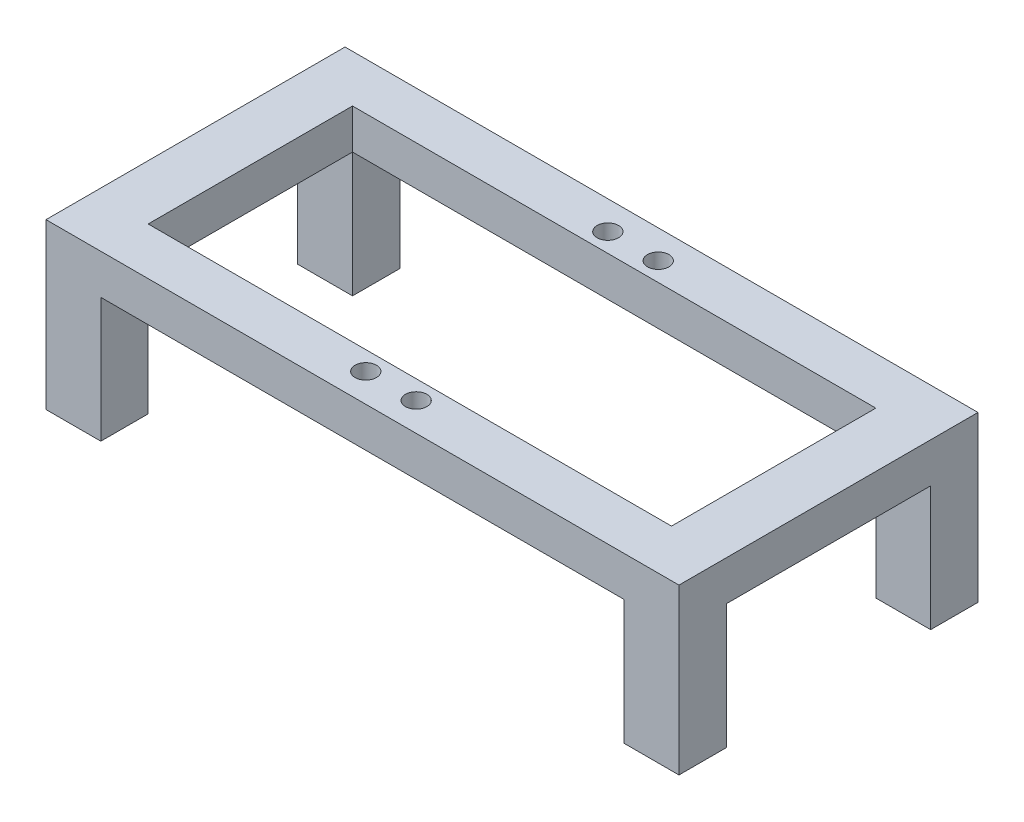
ISO-10303-21;
HEADER;
FILE_DESCRIPTION(('STEP AP214'),'2;1');
FILE_NAME('part.step','',(''),(''),'','','');
FILE_SCHEMA(('AUTOMOTIVE_DESIGN { 1 0 10303 214 1 1 1 1 }'));
ENDSEC;
DATA;
#1=APPLICATION_CONTEXT('core data for automotive mechanical design processes');
#2=APPLICATION_PROTOCOL_DEFINITION('international standard','automotive_design',2000,#1);
#3=PRODUCT_CONTEXT('',#1,'mechanical');
#4=PRODUCT('Part','Part','',(#3));
#5=PRODUCT_RELATED_PRODUCT_CATEGORY('part','',(#4));
#6=PRODUCT_DEFINITION_FORMATION('','',#4);
#7=PRODUCT_DEFINITION_CONTEXT('part definition',#1,'design');
#8=PRODUCT_DEFINITION('design','',#6,#7);
#9=PRODUCT_DEFINITION_SHAPE('','',#8);
#10=(LENGTH_UNIT() NAMED_UNIT(*) SI_UNIT(.MILLI.,.METRE.));
#11=(NAMED_UNIT(*) PLANE_ANGLE_UNIT() SI_UNIT($,.RADIAN.));
#12=(NAMED_UNIT(*) SI_UNIT($,.STERADIAN.) SOLID_ANGLE_UNIT());
#13=UNCERTAINTY_MEASURE_WITH_UNIT(LENGTH_MEASURE(1.E-05),#10,'distance_accuracy_value','');
#14=(GEOMETRIC_REPRESENTATION_CONTEXT(3) GLOBAL_UNCERTAINTY_ASSIGNED_CONTEXT((#13)) GLOBAL_UNIT_ASSIGNED_CONTEXT((#10,
#11,#12)) REPRESENTATION_CONTEXT('',''));
#15=CARTESIAN_POINT('',(0.,0.,0.));
#16=DIRECTION('',(0.,0.,1.));
#17=DIRECTION('',(1.,0.,0.));
#18=AXIS2_PLACEMENT_3D('',#15,#16,#17);
#19=CARTESIAN_POINT('',(0.,-8.,0.));
#20=DIRECTION('',(0.,1.,0.));
#21=DIRECTION('',(0.,0.,1.));
#22=AXIS2_PLACEMENT_3D('',#19,#20,#21);
#23=PLANE('',#22);
#24=DIRECTION('',(0.,0.,1.));
#25=VECTOR('',#24,1.);
#26=CARTESIAN_POINT('',(-52.5,-8.,-30.));
#27=LINE('',#26,#25);
#28=CARTESIAN_POINT('',(-52.5,-8.,-30.));
#29=VERTEX_POINT('',#28);
#30=CARTESIAN_POINT('',(-52.5,-8.,-20.5));
#31=VERTEX_POINT('',#30);
#32=EDGE_CURVE('E185',#29,#31,#27,.T.);
#33=ORIENTED_EDGE('',*,*,#32,.F.);
#34=DIRECTION('',(-1.,0.,0.));
#35=VECTOR('',#34,1.);
#36=CARTESIAN_POINT('',(-63.5,-8.,-30.));
#37=LINE('',#36,#35);
#38=CARTESIAN_POINT('',(52.5,-8.,-30.));
#39=VERTEX_POINT('',#38);
#40=EDGE_CURVE('E321',#39,#29,#37,.T.);
#41=ORIENTED_EDGE('',*,*,#40,.F.);
#42=DIRECTION('',(0.,0.,-1.));
#43=VECTOR('',#42,1.);
#44=CARTESIAN_POINT('',(52.5,-8.,-30.));
#45=LINE('',#44,#43);
#46=CARTESIAN_POINT('',(52.5,-8.,-20.5));
#47=VERTEX_POINT('',#46);
#48=EDGE_CURVE('E202',#47,#39,#45,.T.);
#49=ORIENTED_EDGE('',*,*,#48,.F.);
#50=DIRECTION('',(-1.,0.,0.));
#51=VECTOR('',#50,1.);
#52=CARTESIAN_POINT('',(-52.5,-8.,-20.5));
#53=LINE('',#52,#51);
#54=EDGE_CURVE('E290',#47,#31,#53,.T.);
#55=ORIENTED_EDGE('',*,*,#54,.T.);
#56=EDGE_LOOP('',(#33,#41,#49,#55));
#57=FACE_BOUND('',#56,.T.);
#58=ADVANCED_FACE('F33',(#57),#23,.F.);
#59=DIRECTION('',(-1.,0.,0.));
#60=VECTOR('',#59,1.);
#61=CARTESIAN_POINT('',(-63.5,-8.,-20.5));
#62=LINE('',#61,#60);
#63=CARTESIAN_POINT('',(-63.5,-8.,-20.5));
#64=VERTEX_POINT('',#63);
#65=EDGE_CURVE('E183',#31,#64,#62,.T.);
#66=ORIENTED_EDGE('',*,*,#65,.F.);
#67=DIRECTION('',(0.,0.,1.));
#68=VECTOR('',#67,1.);
#69=CARTESIAN_POINT('',(-52.5,-8.,-20.5));
#70=LINE('',#69,#68);
#71=CARTESIAN_POINT('',(-52.5,-8.,20.5));
#72=VERTEX_POINT('',#71);
#73=EDGE_CURVE('E294',#31,#72,#70,.T.);
#74=ORIENTED_EDGE('',*,*,#73,.T.);
#75=DIRECTION('',(1.,0.,0.));
#76=VECTOR('',#75,1.);
#77=CARTESIAN_POINT('',(-63.5,-8.,20.5));
#78=LINE('',#77,#76);
#79=CARTESIAN_POINT('',(-63.5,-8.,20.5));
#80=VERTEX_POINT('',#79);
#81=EDGE_CURVE('E237',#80,#72,#78,.T.);
#82=ORIENTED_EDGE('',*,*,#81,.F.);
#83=DIRECTION('',(0.,0.,1.));
#84=VECTOR('',#83,1.);
#85=CARTESIAN_POINT('',(-63.5,-8.,-30.));
#86=LINE('',#85,#84);
#87=EDGE_CURVE('E58',#64,#80,#86,.T.);
#88=ORIENTED_EDGE('',*,*,#87,.F.);
#89=EDGE_LOOP('',(#66,#74,#82,#88));
#90=FACE_BOUND('',#89,.T.);
#91=ADVANCED_FACE('F370',(#90),#23,.F.);
#92=DIRECTION('',(-1.,0.,0.));
#93=VECTOR('',#92,1.);
#94=CARTESIAN_POINT('',(63.5,-8.,-20.5));
#95=LINE('',#94,#93);
#96=CARTESIAN_POINT('',(63.5,-8.,-20.5));
#97=VERTEX_POINT('',#96);
#98=EDGE_CURVE('E197',#97,#47,#95,.T.);
#99=ORIENTED_EDGE('',*,*,#98,.F.);
#100=DIRECTION('',(0.,0.,-1.));
#101=VECTOR('',#100,1.);
#102=CARTESIAN_POINT('',(63.5,-8.,-30.));
#103=LINE('',#102,#101);
#104=CARTESIAN_POINT('',(63.5,-8.,20.5));
#105=VERTEX_POINT('',#104);
#106=EDGE_CURVE('E318',#105,#97,#103,.T.);
#107=ORIENTED_EDGE('',*,*,#106,.F.);
#108=DIRECTION('',(1.,0.,0.));
#109=VECTOR('',#108,1.);
#110=CARTESIAN_POINT('',(63.5,-8.,20.5));
#111=LINE('',#110,#109);
#112=CARTESIAN_POINT('',(52.5,-8.,20.5));
#113=VERTEX_POINT('',#112);
#114=EDGE_CURVE('E221',#113,#105,#111,.T.);
#115=ORIENTED_EDGE('',*,*,#114,.F.);
#116=DIRECTION('',(0.,0.,-1.));
#117=VECTOR('',#116,1.);
#118=CARTESIAN_POINT('',(52.5,-8.,-20.5));
#119=LINE('',#118,#117);
#120=EDGE_CURVE('E287',#113,#47,#119,.T.);
#121=ORIENTED_EDGE('',*,*,#120,.T.);
#122=EDGE_LOOP('',(#99,#107,#115,#121));
#123=FACE_BOUND('',#122,.T.);
#124=ADVANCED_FACE('F413',(#123),#23,.F.);
#125=DIRECTION('',(0.,0.,-1.));
#126=VECTOR('',#125,1.);
#127=CARTESIAN_POINT('',(52.5,-8.,30.));
#128=LINE('',#127,#126);
#129=CARTESIAN_POINT('',(52.5,-8.,30.));
#130=VERTEX_POINT('',#129);
#131=EDGE_CURVE('E216',#130,#113,#128,.T.);
#132=ORIENTED_EDGE('',*,*,#131,.F.);
#133=DIRECTION('',(1.,0.,0.));
#134=VECTOR('',#133,1.);
#135=CARTESIAN_POINT('',(-63.5,-8.,30.));
#136=LINE('',#135,#134);
#137=CARTESIAN_POINT('',(-52.5,-8.,30.));
#138=VERTEX_POINT('',#137);
#139=EDGE_CURVE('E325',#138,#130,#136,.T.);
#140=ORIENTED_EDGE('',*,*,#139,.F.);
#141=DIRECTION('',(0.,0.,1.));
#142=VECTOR('',#141,1.);
#143=CARTESIAN_POINT('',(-52.5,-8.,30.));
#144=LINE('',#143,#142);
#145=EDGE_CURVE('E242',#72,#138,#144,.T.);
#146=ORIENTED_EDGE('',*,*,#145,.F.);
#147=DIRECTION('',(1.,0.,0.));
#148=VECTOR('',#147,1.);
#149=CARTESIAN_POINT('',(-52.5,-8.,20.5));
#150=LINE('',#149,#148);
#151=EDGE_CURVE('E296',#72,#113,#150,.T.);
#152=ORIENTED_EDGE('',*,*,#151,.T.);
#153=EDGE_LOOP('',(#132,#140,#146,#152));
#154=FACE_BOUND('',#153,.T.);
#155=ADVANCED_FACE('F390',(#154),#23,.F.);
#156=CARTESIAN_POINT('',(63.5,-8.,-30.));
#157=DIRECTION('',(1.,0.,0.));
#158=DIRECTION('',(0.,0.,-1.));
#159=AXIS2_PLACEMENT_3D('',#156,#157,#158);
#160=PLANE('',#159);
#161=DIRECTION('',(0.,0.,-1.));
#162=VECTOR('',#161,1.);
#163=CARTESIAN_POINT('',(63.5,0.,-30.));
#164=LINE('',#163,#162);
#165=CARTESIAN_POINT('',(63.5,0.,30.));
#166=VERTEX_POINT('',#165);
#167=CARTESIAN_POINT('',(63.5,0.,-30.));
#168=VERTEX_POINT('',#167);
#169=EDGE_CURVE('E311',#166,#168,#164,.T.);
#170=ORIENTED_EDGE('',*,*,#169,.F.);
#171=DIRECTION('',(0.,1.,0.));
#172=VECTOR('',#171,1.);
#173=CARTESIAN_POINT('',(63.5,-8.,30.));
#174=LINE('',#173,#172);
#175=CARTESIAN_POINT('',(63.5,-33.,30.));
#176=VERTEX_POINT('',#175);
#177=EDGE_CURVE('E11',#176,#166,#174,.T.);
#178=ORIENTED_EDGE('',*,*,#177,.F.);
#179=DIRECTION('',(0.,0.,1.));
#180=VECTOR('',#179,1.);
#181=CARTESIAN_POINT('',(63.5,-33.,30.));
#182=LINE('',#181,#180);
#183=CARTESIAN_POINT('',(63.5,-33.,20.5));
#184=VERTEX_POINT('',#183);
#185=EDGE_CURVE('E217',#184,#176,#182,.T.);
#186=ORIENTED_EDGE('',*,*,#185,.F.);
#187=DIRECTION('',(0.,1.,0.));
#188=VECTOR('',#187,1.);
#189=CARTESIAN_POINT('',(63.5,-33.,20.5));
#190=LINE('',#189,#188);
#191=EDGE_CURVE('E227',#184,#105,#190,.T.);
#192=ORIENTED_EDGE('',*,*,#191,.T.);
#193=ORIENTED_EDGE('',*,*,#106,.T.);
#194=DIRECTION('',(0.,1.,0.));
#195=VECTOR('',#194,1.);
#196=CARTESIAN_POINT('',(63.5,-33.,-20.5));
#197=LINE('',#196,#195);
#198=CARTESIAN_POINT('',(63.5,-33.,-20.5));
#199=VERTEX_POINT('',#198);
#200=EDGE_CURVE('E214',#199,#97,#197,.T.);
#201=ORIENTED_EDGE('',*,*,#200,.F.);
#202=DIRECTION('',(0.,0.,1.));
#203=VECTOR('',#202,1.);
#204=CARTESIAN_POINT('',(63.5,-33.,-30.));
#205=LINE('',#204,#203);
#206=CARTESIAN_POINT('',(63.5,-33.,-30.));
#207=VERTEX_POINT('',#206);
#208=EDGE_CURVE('E201',#207,#199,#205,.T.);
#209=ORIENTED_EDGE('',*,*,#208,.F.);
#210=DIRECTION('',(0.,1.,0.));
#211=VECTOR('',#210,1.);
#212=CARTESIAN_POINT('',(63.5,-8.,-30.));
#213=LINE('',#212,#211);
#214=EDGE_CURVE('E37',#207,#168,#213,.T.);
#215=ORIENTED_EDGE('',*,*,#214,.T.);
#216=EDGE_LOOP('',(#170,#178,#186,#192,#193,#201,#209,#215));
#217=FACE_BOUND('',#216,.T.);
#218=ADVANCED_FACE('F35',(#217),#160,.T.);
#219=CARTESIAN_POINT('',(-63.5,-8.,30.));
#220=DIRECTION('',(0.,0.,1.));
#221=DIRECTION('',(1.,0.,0.));
#222=AXIS2_PLACEMENT_3D('',#219,#220,#221);
#223=PLANE('',#222);
#224=DIRECTION('',(1.,0.,0.));
#225=VECTOR('',#224,1.);
#226=CARTESIAN_POINT('',(-63.5,0.,30.));
#227=LINE('',#226,#225);
#228=CARTESIAN_POINT('',(-63.5,0.,30.));
#229=VERTEX_POINT('',#228);
#230=EDGE_CURVE('E322',#229,#166,#227,.T.);
#231=ORIENTED_EDGE('',*,*,#230,.F.);
#232=DIRECTION('',(0.,1.,0.));
#233=VECTOR('',#232,1.);
#234=CARTESIAN_POINT('',(-63.5,-8.,30.));
#235=LINE('',#234,#233);
#236=CARTESIAN_POINT('',(-63.5,-33.,30.));
#237=VERTEX_POINT('',#236);
#238=EDGE_CURVE('E42',#237,#229,#235,.T.);
#239=ORIENTED_EDGE('',*,*,#238,.F.);
#240=DIRECTION('',(-1.,0.,0.));
#241=VECTOR('',#240,1.);
#242=CARTESIAN_POINT('',(-63.5,-33.,30.));
#243=LINE('',#242,#241);
#244=CARTESIAN_POINT('',(-52.5,-33.,30.));
#245=VERTEX_POINT('',#244);
#246=EDGE_CURVE('E246',#245,#237,#243,.T.);
#247=ORIENTED_EDGE('',*,*,#246,.F.);
#248=DIRECTION('',(0.,1.,0.));
#249=VECTOR('',#248,1.);
#250=CARTESIAN_POINT('',(-52.5,-33.,30.));
#251=LINE('',#250,#249);
#252=EDGE_CURVE('E249',#245,#138,#251,.T.);
#253=ORIENTED_EDGE('',*,*,#252,.T.);
#254=ORIENTED_EDGE('',*,*,#139,.T.);
#255=DIRECTION('',(0.,1.,0.));
#256=VECTOR('',#255,1.);
#257=CARTESIAN_POINT('',(52.5,-33.,30.));
#258=LINE('',#257,#256);
#259=CARTESIAN_POINT('',(52.5,-33.,30.));
#260=VERTEX_POINT('',#259);
#261=EDGE_CURVE('E235',#260,#130,#258,.T.);
#262=ORIENTED_EDGE('',*,*,#261,.F.);
#263=DIRECTION('',(-1.,0.,0.));
#264=VECTOR('',#263,1.);
#265=CARTESIAN_POINT('',(63.5,-33.,30.));
#266=LINE('',#265,#264);
#267=EDGE_CURVE('E220',#176,#260,#266,.T.);
#268=ORIENTED_EDGE('',*,*,#267,.F.);
#269=ORIENTED_EDGE('',*,*,#177,.T.);
#270=EDGE_LOOP('',(#231,#239,#247,#253,#254,#262,#268,#269));
#271=FACE_BOUND('',#270,.T.);
#272=ADVANCED_FACE('F341',(#271),#223,.T.);
#273=CARTESIAN_POINT('',(-63.5,-8.,-30.));
#274=DIRECTION('',(-1.,0.,0.));
#275=DIRECTION('',(0.,0.,1.));
#276=AXIS2_PLACEMENT_3D('',#273,#274,#275);
#277=PLANE('',#276);
#278=DIRECTION('',(0.,0.,1.));
#279=VECTOR('',#278,1.);
#280=CARTESIAN_POINT('',(-63.5,0.,-30.));
#281=LINE('',#280,#279);
#282=CARTESIAN_POINT('',(-63.5,0.,-30.));
#283=VERTEX_POINT('',#282);
#284=EDGE_CURVE('E168',#283,#229,#281,.T.);
#285=ORIENTED_EDGE('',*,*,#284,.F.);
#286=DIRECTION('',(0.,1.,0.));
#287=VECTOR('',#286,1.);
#288=CARTESIAN_POINT('',(-63.5,-8.,-30.));
#289=LINE('',#288,#287);
#290=CARTESIAN_POINT('',(-63.5,-33.,-30.));
#291=VERTEX_POINT('',#290);
#292=EDGE_CURVE('E162',#291,#283,#289,.T.);
#293=ORIENTED_EDGE('',*,*,#292,.F.);
#294=DIRECTION('',(0.,0.,-1.));
#295=VECTOR('',#294,1.);
#296=CARTESIAN_POINT('',(-63.5,-33.,-30.));
#297=LINE('',#296,#295);
#298=CARTESIAN_POINT('',(-63.5,-33.,-20.5));
#299=VERTEX_POINT('',#298);
#300=EDGE_CURVE('E166',#299,#291,#297,.T.);
#301=ORIENTED_EDGE('',*,*,#300,.F.);
#302=DIRECTION('',(0.,1.,0.));
#303=VECTOR('',#302,1.);
#304=CARTESIAN_POINT('',(-63.5,-33.,-20.5));
#305=LINE('',#304,#303);
#306=EDGE_CURVE('E190',#299,#64,#305,.T.);
#307=ORIENTED_EDGE('',*,*,#306,.T.);
#308=ORIENTED_EDGE('',*,*,#87,.T.);
#309=DIRECTION('',(0.,1.,0.));
#310=VECTOR('',#309,1.);
#311=CARTESIAN_POINT('',(-63.5,-33.,20.5));
#312=LINE('',#311,#310);
#313=CARTESIAN_POINT('',(-63.5,-33.,20.5));
#314=VERTEX_POINT('',#313);
#315=EDGE_CURVE('E259',#314,#80,#312,.T.);
#316=ORIENTED_EDGE('',*,*,#315,.F.);
#317=DIRECTION('',(0.,0.,-1.));
#318=VECTOR('',#317,1.);
#319=CARTESIAN_POINT('',(-63.5,-33.,30.));
#320=LINE('',#319,#318);
#321=EDGE_CURVE('E238',#237,#314,#320,.T.);
#322=ORIENTED_EDGE('',*,*,#321,.F.);
#323=ORIENTED_EDGE('',*,*,#238,.T.);
#324=EDGE_LOOP('',(#285,#293,#301,#307,#308,#316,#322,#323));
#325=FACE_BOUND('',#324,.T.);
#326=ADVANCED_FACE('F164',(#325),#277,.T.);
#327=CARTESIAN_POINT('',(-63.5,-8.,-30.));
#328=DIRECTION('',(0.,0.,-1.));
#329=DIRECTION('',(-1.,0.,0.));
#330=AXIS2_PLACEMENT_3D('',#327,#328,#329);
#331=PLANE('',#330);
#332=DIRECTION('',(-1.,0.,0.));
#333=VECTOR('',#332,1.);
#334=CARTESIAN_POINT('',(-63.5,0.,-30.));
#335=LINE('',#334,#333);
#336=EDGE_CURVE('E330',#168,#283,#335,.T.);
#337=ORIENTED_EDGE('',*,*,#336,.F.);
#338=ORIENTED_EDGE('',*,*,#214,.F.);
#339=DIRECTION('',(1.,0.,0.));
#340=VECTOR('',#339,1.);
#341=CARTESIAN_POINT('',(63.5,-33.,-30.));
#342=LINE('',#341,#340);
#343=CARTESIAN_POINT('',(52.5,-33.,-30.));
#344=VERTEX_POINT('',#343);
#345=EDGE_CURVE('E198',#344,#207,#342,.T.);
#346=ORIENTED_EDGE('',*,*,#345,.F.);
#347=DIRECTION('',(0.,1.,0.));
#348=VECTOR('',#347,1.);
#349=CARTESIAN_POINT('',(52.5,-33.,-30.));
#350=LINE('',#349,#348);
#351=EDGE_CURVE('E50',#344,#39,#350,.T.);
#352=ORIENTED_EDGE('',*,*,#351,.T.);
#353=ORIENTED_EDGE('',*,*,#40,.T.);
#354=DIRECTION('',(0.,1.,0.));
#355=VECTOR('',#354,1.);
#356=CARTESIAN_POINT('',(-52.5,-33.,-30.));
#357=LINE('',#356,#355);
#358=CARTESIAN_POINT('',(-52.5,-33.,-30.));
#359=VERTEX_POINT('',#358);
#360=EDGE_CURVE('E174',#359,#29,#357,.T.);
#361=ORIENTED_EDGE('',*,*,#360,.F.);
#362=DIRECTION('',(1.,0.,0.));
#363=VECTOR('',#362,1.);
#364=CARTESIAN_POINT('',(-63.5,-33.,-30.));
#365=LINE('',#364,#363);
#366=EDGE_CURVE('E172',#291,#359,#365,.T.);
#367=ORIENTED_EDGE('',*,*,#366,.F.);
#368=ORIENTED_EDGE('',*,*,#292,.T.);
#369=EDGE_LOOP('',(#337,#338,#346,#352,#353,#361,#367,#368));
#370=FACE_BOUND('',#369,.T.);
#371=ADVANCED_FACE('F173',(#370),#331,.T.);
#372=CARTESIAN_POINT('',(0.,0.,0.));
#373=DIRECTION('',(0.,1.,0.));
#374=DIRECTION('',(0.,0.,1.));
#375=AXIS2_PLACEMENT_3D('',#372,#373,#374);
#376=PLANE('',#375);
#377=CARTESIAN_POINT('',(-5.055,0.,24.285));
#378=DIRECTION('',(0.,1.,0.));
#379=DIRECTION('',(0.,0.,1.));
#380=AXIS2_PLACEMENT_3D('',#377,#378,#379);
#381=CIRCLE('',#380,2.15);
#382=CARTESIAN_POINT('',(-5.055,0.,26.435));
#383=VERTEX_POINT('',#382);
#384=EDGE_CURVE('E269',#383,#383,#381,.T.);
#385=ORIENTED_EDGE('',*,*,#384,.F.);
#386=EDGE_LOOP('',(#385));
#387=FACE_BOUND('',#386,.T.);
#388=CARTESIAN_POINT('',(5.055,0.,-24.285));
#389=DIRECTION('',(0.,1.,0.));
#390=DIRECTION('',(0.,0.,1.));
#391=AXIS2_PLACEMENT_3D('',#388,#389,#390);
#392=CIRCLE('',#391,2.15);
#393=CARTESIAN_POINT('',(5.055,0.,-22.135));
#394=VERTEX_POINT('',#393);
#395=EDGE_CURVE('E276',#394,#394,#392,.T.);
#396=ORIENTED_EDGE('',*,*,#395,.F.);
#397=EDGE_LOOP('',(#396));
#398=FACE_BOUND('',#397,.T.);
#399=CARTESIAN_POINT('',(-5.055,0.,-24.285));
#400=DIRECTION('',(0.,1.,0.));
#401=DIRECTION('',(0.,0.,1.));
#402=AXIS2_PLACEMENT_3D('',#399,#400,#401);
#403=CIRCLE('',#402,2.15);
#404=CARTESIAN_POINT('',(-5.055,0.,-22.135));
#405=VERTEX_POINT('',#404);
#406=EDGE_CURVE('E263',#405,#405,#403,.T.);
#407=ORIENTED_EDGE('',*,*,#406,.F.);
#408=EDGE_LOOP('',(#407));
#409=FACE_BOUND('',#408,.T.);
#410=CARTESIAN_POINT('',(5.055,0.,24.285));
#411=DIRECTION('',(0.,1.,0.));
#412=DIRECTION('',(0.,0.,1.));
#413=AXIS2_PLACEMENT_3D('',#410,#411,#412);
#414=CIRCLE('',#413,2.15);
#415=CARTESIAN_POINT('',(5.055,0.,26.435));
#416=VERTEX_POINT('',#415);
#417=EDGE_CURVE('E272',#416,#416,#414,.T.);
#418=ORIENTED_EDGE('',*,*,#417,.F.);
#419=EDGE_LOOP('',(#418));
#420=FACE_BOUND('',#419,.T.);
#421=DIRECTION('',(0.,0.,-1.));
#422=VECTOR('',#421,1.);
#423=CARTESIAN_POINT('',(52.5,0.,-20.5));
#424=LINE('',#423,#422);
#425=CARTESIAN_POINT('',(52.5,0.,20.5));
#426=VERTEX_POINT('',#425);
#427=CARTESIAN_POINT('',(52.5,0.,-20.5));
#428=VERTEX_POINT('',#427);
#429=EDGE_CURVE('E284',#426,#428,#424,.T.);
#430=ORIENTED_EDGE('',*,*,#429,.F.);
#431=DIRECTION('',(1.,0.,0.));
#432=VECTOR('',#431,1.);
#433=CARTESIAN_POINT('',(-52.5,0.,20.5));
#434=LINE('',#433,#432);
#435=CARTESIAN_POINT('',(-52.5,0.,20.5));
#436=VERTEX_POINT('',#435);
#437=EDGE_CURVE('E291',#436,#426,#434,.T.);
#438=ORIENTED_EDGE('',*,*,#437,.F.);
#439=DIRECTION('',(0.,0.,1.));
#440=VECTOR('',#439,1.);
#441=CARTESIAN_POINT('',(-52.5,0.,-20.5));
#442=LINE('',#441,#440);
#443=CARTESIAN_POINT('',(-52.5,0.,-20.5));
#444=VERTEX_POINT('',#443);
#445=EDGE_CURVE('E304',#444,#436,#442,.T.);
#446=ORIENTED_EDGE('',*,*,#445,.F.);
#447=DIRECTION('',(-1.,0.,0.));
#448=VECTOR('',#447,1.);
#449=CARTESIAN_POINT('',(-52.5,0.,-20.5));
#450=LINE('',#449,#448);
#451=EDGE_CURVE('E301',#428,#444,#450,.T.);
#452=ORIENTED_EDGE('',*,*,#451,.F.);
#453=EDGE_LOOP('',(#430,#438,#446,#452));
#454=FACE_BOUND('',#453,.T.);
#455=ORIENTED_EDGE('',*,*,#169,.T.);
#456=ORIENTED_EDGE('',*,*,#336,.T.);
#457=ORIENTED_EDGE('',*,*,#284,.T.);
#458=ORIENTED_EDGE('',*,*,#230,.T.);
#459=EDGE_LOOP('',(#455,#456,#457,#458));
#460=FACE_BOUND('',#459,.T.);
#461=ADVANCED_FACE('F340',(#387,#398,#409,#420,#454,#460),#376,.T.);
#462=CARTESIAN_POINT('',(52.5,-8.,-20.5));
#463=DIRECTION('',(1.,0.,0.));
#464=DIRECTION('',(0.,0.,-1.));
#465=AXIS2_PLACEMENT_3D('',#462,#463,#464);
#466=PLANE('',#465);
#467=ORIENTED_EDGE('',*,*,#429,.T.);
#468=DIRECTION('',(0.,1.,0.));
#469=VECTOR('',#468,1.);
#470=CARTESIAN_POINT('',(52.5,-8.,-20.5));
#471=LINE('',#470,#469);
#472=EDGE_CURVE('E299',#47,#428,#471,.T.);
#473=ORIENTED_EDGE('',*,*,#472,.F.);
#474=ORIENTED_EDGE('',*,*,#120,.F.);
#475=DIRECTION('',(0.,1.,0.));
#476=VECTOR('',#475,1.);
#477=CARTESIAN_POINT('',(52.5,-8.,20.5));
#478=LINE('',#477,#476);
#479=EDGE_CURVE('E309',#113,#426,#478,.T.);
#480=ORIENTED_EDGE('',*,*,#479,.T.);
#481=EDGE_LOOP('',(#467,#473,#474,#480));
#482=FACE_BOUND('',#481,.T.);
#483=ADVANCED_FACE('F605',(#482),#466,.F.);
#484=CARTESIAN_POINT('',(-52.5,-8.,20.5));
#485=DIRECTION('',(0.,0.,1.));
#486=DIRECTION('',(1.,0.,0.));
#487=AXIS2_PLACEMENT_3D('',#484,#485,#486);
#488=PLANE('',#487);
#489=ORIENTED_EDGE('',*,*,#437,.T.);
#490=ORIENTED_EDGE('',*,*,#479,.F.);
#491=ORIENTED_EDGE('',*,*,#151,.F.);
#492=DIRECTION('',(0.,1.,0.));
#493=VECTOR('',#492,1.);
#494=CARTESIAN_POINT('',(-52.5,-8.,20.5));
#495=LINE('',#494,#493);
#496=EDGE_CURVE('E312',#72,#436,#495,.T.);
#497=ORIENTED_EDGE('',*,*,#496,.T.);
#498=EDGE_LOOP('',(#489,#490,#491,#497));
#499=FACE_BOUND('',#498,.T.);
#500=ADVANCED_FACE('F386',(#499),#488,.F.);
#501=CARTESIAN_POINT('',(-52.5,-8.,-20.5));
#502=DIRECTION('',(-1.,0.,0.));
#503=DIRECTION('',(0.,0.,1.));
#504=AXIS2_PLACEMENT_3D('',#501,#502,#503);
#505=PLANE('',#504);
#506=ORIENTED_EDGE('',*,*,#445,.T.);
#507=ORIENTED_EDGE('',*,*,#496,.F.);
#508=ORIENTED_EDGE('',*,*,#73,.F.);
#509=DIRECTION('',(0.,1.,0.));
#510=VECTOR('',#509,1.);
#511=CARTESIAN_POINT('',(-52.5,-8.,-20.5));
#512=LINE('',#511,#510);
#513=EDGE_CURVE('E314',#31,#444,#512,.T.);
#514=ORIENTED_EDGE('',*,*,#513,.T.);
#515=EDGE_LOOP('',(#506,#507,#508,#514));
#516=FACE_BOUND('',#515,.T.);
#517=ADVANCED_FACE('F375',(#516),#505,.F.);
#518=CARTESIAN_POINT('',(-52.5,-8.,-20.5));
#519=DIRECTION('',(0.,0.,-1.));
#520=DIRECTION('',(-1.,0.,0.));
#521=AXIS2_PLACEMENT_3D('',#518,#519,#520);
#522=PLANE('',#521);
#523=ORIENTED_EDGE('',*,*,#451,.T.);
#524=ORIENTED_EDGE('',*,*,#513,.F.);
#525=ORIENTED_EDGE('',*,*,#54,.F.);
#526=ORIENTED_EDGE('',*,*,#472,.T.);
#527=EDGE_LOOP('',(#523,#524,#525,#526));
#528=FACE_BOUND('',#527,.T.);
#529=ADVANCED_FACE('F378',(#528),#522,.F.);
#530=CARTESIAN_POINT('',(5.055,-5.159375,24.285));
#531=DIRECTION('',(0.,1.,0.));
#532=DIRECTION('',(0.,0.,1.));
#533=AXIS2_PLACEMENT_3D('',#530,#531,#532);
#534=CYLINDRICAL_SURFACE('',#533,2.15);
#535=CARTESIAN_POINT('',(5.055,-5.159375,24.285));
#536=DIRECTION('',(0.,1.,0.));
#537=DIRECTION('',(0.,0.,1.));
#538=AXIS2_PLACEMENT_3D('',#535,#536,#537);
#539=CIRCLE('',#538,2.15);
#540=CARTESIAN_POINT('',(5.055,-5.159375,26.435));
#541=VERTEX_POINT('',#540);
#542=EDGE_CURVE('E281',#541,#541,#539,.T.);
#543=ORIENTED_EDGE('',*,*,#542,.F.);
#544=EDGE_LOOP('',(#543));
#545=FACE_BOUND('',#544,.T.);
#546=ORIENTED_EDGE('',*,*,#417,.T.);
#547=EDGE_LOOP('',(#546));
#548=FACE_BOUND('',#547,.T.);
#549=ADVANCED_FACE('F633',(#545,#548),#534,.F.);
#550=CARTESIAN_POINT('',(5.055,-5.159375,24.285));
#551=DIRECTION('',(0.,1.,0.));
#552=DIRECTION('',(0.,0.,1.));
#553=AXIS2_PLACEMENT_3D('',#550,#551,#552);
#554=PLANE('',#553);
#555=ORIENTED_EDGE('',*,*,#542,.T.);
#556=EDGE_LOOP('',(#555));
#557=FACE_BOUND('',#556,.T.);
#558=ADVANCED_FACE('F640',(#557),#554,.T.);
#559=CARTESIAN_POINT('',(-5.055,-5.159375,-24.285));
#560=DIRECTION('',(0.,1.,0.));
#561=DIRECTION('',(0.,0.,1.));
#562=AXIS2_PLACEMENT_3D('',#559,#560,#561);
#563=CYLINDRICAL_SURFACE('',#562,2.15);
#564=CARTESIAN_POINT('',(-5.055,-5.159375,-24.285));
#565=DIRECTION('',(0.,1.,0.));
#566=DIRECTION('',(0.,0.,1.));
#567=AXIS2_PLACEMENT_3D('',#564,#565,#566);
#568=CIRCLE('',#567,2.15);
#569=CARTESIAN_POINT('',(-5.055,-5.159375,-22.135));
#570=VERTEX_POINT('',#569);
#571=EDGE_CURVE('E262',#570,#570,#568,.T.);
#572=ORIENTED_EDGE('',*,*,#571,.F.);
#573=EDGE_LOOP('',(#572));
#574=FACE_BOUND('',#573,.T.);
#575=ORIENTED_EDGE('',*,*,#406,.T.);
#576=EDGE_LOOP('',(#575));
#577=FACE_BOUND('',#576,.T.);
#578=ADVANCED_FACE('F649',(#574,#577),#563,.F.);
#579=CARTESIAN_POINT('',(-5.055,-5.159375,-24.285));
#580=DIRECTION('',(0.,1.,0.));
#581=DIRECTION('',(0.,0.,1.));
#582=AXIS2_PLACEMENT_3D('',#579,#580,#581);
#583=PLANE('',#582);
#584=ORIENTED_EDGE('',*,*,#571,.T.);
#585=EDGE_LOOP('',(#584));
#586=FACE_BOUND('',#585,.T.);
#587=ADVANCED_FACE('F658',(#586),#583,.T.);
#588=CARTESIAN_POINT('',(5.055,-5.159375,-24.285));
#589=DIRECTION('',(0.,1.,0.));
#590=DIRECTION('',(0.,0.,1.));
#591=AXIS2_PLACEMENT_3D('',#588,#589,#590);
#592=CYLINDRICAL_SURFACE('',#591,2.15);
#593=CARTESIAN_POINT('',(5.055,-5.159375,-24.285));
#594=DIRECTION('',(0.,1.,0.));
#595=DIRECTION('',(0.,0.,1.));
#596=AXIS2_PLACEMENT_3D('',#593,#594,#595);
#597=CIRCLE('',#596,2.15);
#598=CARTESIAN_POINT('',(5.055,-5.159375,-22.135));
#599=VERTEX_POINT('',#598);
#600=EDGE_CURVE('E266',#599,#599,#597,.T.);
#601=ORIENTED_EDGE('',*,*,#600,.F.);
#602=EDGE_LOOP('',(#601));
#603=FACE_BOUND('',#602,.T.);
#604=ORIENTED_EDGE('',*,*,#395,.T.);
#605=EDGE_LOOP('',(#604));
#606=FACE_BOUND('',#605,.T.);
#607=ADVANCED_FACE('F667',(#603,#606),#592,.F.);
#608=CARTESIAN_POINT('',(5.055,-5.159375,-24.285));
#609=DIRECTION('',(0.,1.,0.));
#610=DIRECTION('',(0.,0.,1.));
#611=AXIS2_PLACEMENT_3D('',#608,#609,#610);
#612=PLANE('',#611);
#613=ORIENTED_EDGE('',*,*,#600,.T.);
#614=EDGE_LOOP('',(#613));
#615=FACE_BOUND('',#614,.T.);
#616=ADVANCED_FACE('F676',(#615),#612,.T.);
#617=CARTESIAN_POINT('',(-5.055,-5.159375,24.285));
#618=DIRECTION('',(0.,1.,0.));
#619=DIRECTION('',(0.,0.,1.));
#620=AXIS2_PLACEMENT_3D('',#617,#618,#619);
#621=CYLINDRICAL_SURFACE('',#620,2.15);
#622=CARTESIAN_POINT('',(-5.055,-5.159375,24.285));
#623=DIRECTION('',(0.,1.,0.));
#624=DIRECTION('',(0.,0.,1.));
#625=AXIS2_PLACEMENT_3D('',#622,#623,#624);
#626=CIRCLE('',#625,2.15);
#627=CARTESIAN_POINT('',(-5.055,-5.159375,26.435));
#628=VERTEX_POINT('',#627);
#629=EDGE_CURVE('E273',#628,#628,#626,.T.);
#630=ORIENTED_EDGE('',*,*,#629,.F.);
#631=EDGE_LOOP('',(#630));
#632=FACE_BOUND('',#631,.T.);
#633=ORIENTED_EDGE('',*,*,#384,.T.);
#634=EDGE_LOOP('',(#633));
#635=FACE_BOUND('',#634,.T.);
#636=ADVANCED_FACE('F685',(#632,#635),#621,.F.);
#637=CARTESIAN_POINT('',(-5.055,-5.159375,24.285));
#638=DIRECTION('',(0.,1.,0.));
#639=DIRECTION('',(0.,0.,1.));
#640=AXIS2_PLACEMENT_3D('',#637,#638,#639);
#641=PLANE('',#640);
#642=ORIENTED_EDGE('',*,*,#629,.T.);
#643=EDGE_LOOP('',(#642));
#644=FACE_BOUND('',#643,.T.);
#645=ADVANCED_FACE('F482',(#644),#641,.T.);
#646=CARTESIAN_POINT('',(-63.5,-33.,20.5));
#647=DIRECTION('',(0.,0.,1.));
#648=DIRECTION('',(1.,0.,0.));
#649=AXIS2_PLACEMENT_3D('',#646,#647,#648);
#650=PLANE('',#649);
#651=ORIENTED_EDGE('',*,*,#81,.T.);
#652=DIRECTION('',(0.,1.,0.));
#653=VECTOR('',#652,1.);
#654=CARTESIAN_POINT('',(-52.5,-33.,20.5));
#655=LINE('',#654,#653);
#656=CARTESIAN_POINT('',(-52.5,-33.,20.5));
#657=VERTEX_POINT('',#656);
#658=EDGE_CURVE('E256',#657,#72,#655,.T.);
#659=ORIENTED_EDGE('',*,*,#658,.F.);
#660=DIRECTION('',(1.,0.,0.));
#661=VECTOR('',#660,1.);
#662=CARTESIAN_POINT('',(-63.5,-33.,20.5));
#663=LINE('',#662,#661);
#664=EDGE_CURVE('E241',#314,#657,#663,.T.);
#665=ORIENTED_EDGE('',*,*,#664,.F.);
#666=ORIENTED_EDGE('',*,*,#315,.T.);
#667=EDGE_LOOP('',(#651,#659,#665,#666));
#668=FACE_BOUND('',#667,.T.);
#669=ADVANCED_FACE('F395',(#668),#650,.F.);
#670=CARTESIAN_POINT('',(-52.5,-33.,30.));
#671=DIRECTION('',(-1.,0.,0.));
#672=DIRECTION('',(0.,0.,1.));
#673=AXIS2_PLACEMENT_3D('',#670,#671,#672);
#674=PLANE('',#673);
#675=ORIENTED_EDGE('',*,*,#145,.T.);
#676=ORIENTED_EDGE('',*,*,#252,.F.);
#677=DIRECTION('',(0.,0.,1.));
#678=VECTOR('',#677,1.);
#679=CARTESIAN_POINT('',(-52.5,-33.,30.));
#680=LINE('',#679,#678);
#681=EDGE_CURVE('E244',#657,#245,#680,.T.);
#682=ORIENTED_EDGE('',*,*,#681,.F.);
#683=ORIENTED_EDGE('',*,*,#658,.T.);
#684=EDGE_LOOP('',(#675,#676,#682,#683));
#685=FACE_BOUND('',#684,.T.);
#686=ADVANCED_FACE('F397',(#685),#674,.F.);
#687=CARTESIAN_POINT('',(0.,-33.,0.));
#688=DIRECTION('',(0.,-1.,0.));
#689=DIRECTION('',(0.,0.,-1.));
#690=AXIS2_PLACEMENT_3D('',#687,#688,#689);
#691=PLANE('',#690);
#692=ORIENTED_EDGE('',*,*,#321,.T.);
#693=ORIENTED_EDGE('',*,*,#664,.T.);
#694=ORIENTED_EDGE('',*,*,#681,.T.);
#695=ORIENTED_EDGE('',*,*,#246,.T.);
#696=EDGE_LOOP('',(#692,#693,#694,#695));
#697=FACE_BOUND('',#696,.T.);
#698=ADVANCED_FACE('F399',(#697),#691,.T.);
#699=CARTESIAN_POINT('',(52.5,-33.,30.));
#700=DIRECTION('',(1.,0.,0.));
#701=DIRECTION('',(0.,0.,-1.));
#702=AXIS2_PLACEMENT_3D('',#699,#700,#701);
#703=PLANE('',#702);
#704=ORIENTED_EDGE('',*,*,#131,.T.);
#705=DIRECTION('',(0.,1.,0.));
#706=VECTOR('',#705,1.);
#707=CARTESIAN_POINT('',(52.5,-33.,20.5));
#708=LINE('',#707,#706);
#709=CARTESIAN_POINT('',(52.5,-33.,20.5));
#710=VERTEX_POINT('',#709);
#711=EDGE_CURVE('E232',#710,#113,#708,.T.);
#712=ORIENTED_EDGE('',*,*,#711,.F.);
#713=DIRECTION('',(0.,0.,-1.));
#714=VECTOR('',#713,1.);
#715=CARTESIAN_POINT('',(52.5,-33.,30.));
#716=LINE('',#715,#714);
#717=EDGE_CURVE('E223',#260,#710,#716,.T.);
#718=ORIENTED_EDGE('',*,*,#717,.F.);
#719=ORIENTED_EDGE('',*,*,#261,.T.);
#720=EDGE_LOOP('',(#704,#712,#718,#719));
#721=FACE_BOUND('',#720,.T.);
#722=ADVANCED_FACE('F403',(#721),#703,.F.);
#723=CARTESIAN_POINT('',(63.5,-33.,20.5));
#724=DIRECTION('',(0.,0.,1.));
#725=DIRECTION('',(1.,0.,0.));
#726=AXIS2_PLACEMENT_3D('',#723,#724,#725);
#727=PLANE('',#726);
#728=ORIENTED_EDGE('',*,*,#114,.T.);
#729=ORIENTED_EDGE('',*,*,#191,.F.);
#730=DIRECTION('',(1.,0.,0.));
#731=VECTOR('',#730,1.);
#732=CARTESIAN_POINT('',(63.5,-33.,20.5));
#733=LINE('',#732,#731);
#734=EDGE_CURVE('E225',#710,#184,#733,.T.);
#735=ORIENTED_EDGE('',*,*,#734,.F.);
#736=ORIENTED_EDGE('',*,*,#711,.T.);
#737=EDGE_LOOP('',(#728,#729,#735,#736));
#738=FACE_BOUND('',#737,.T.);
#739=ADVANCED_FACE('F423',(#738),#727,.F.);
#740=CARTESIAN_POINT('',(0.,-33.,0.));
#741=DIRECTION('',(0.,1.,0.));
#742=DIRECTION('',(0.,0.,1.));
#743=AXIS2_PLACEMENT_3D('',#740,#741,#742);
#744=PLANE('',#743);
#745=ORIENTED_EDGE('',*,*,#185,.T.);
#746=ORIENTED_EDGE('',*,*,#267,.T.);
#747=ORIENTED_EDGE('',*,*,#717,.T.);
#748=ORIENTED_EDGE('',*,*,#734,.T.);
#749=EDGE_LOOP('',(#745,#746,#747,#748));
#750=FACE_BOUND('',#749,.T.);
#751=ADVANCED_FACE('F406',(#750),#744,.F.);
#752=CARTESIAN_POINT('',(63.5,-33.,-20.5));
#753=DIRECTION('',(0.,0.,-1.));
#754=DIRECTION('',(-1.,0.,0.));
#755=AXIS2_PLACEMENT_3D('',#752,#753,#754);
#756=PLANE('',#755);
#757=ORIENTED_EDGE('',*,*,#98,.T.);
#758=DIRECTION('',(0.,1.,0.));
#759=VECTOR('',#758,1.);
#760=CARTESIAN_POINT('',(52.5,-33.,-20.5));
#761=LINE('',#760,#759);
#762=CARTESIAN_POINT('',(52.5,-33.,-20.5));
#763=VERTEX_POINT('',#762);
#764=EDGE_CURVE('E211',#763,#47,#761,.T.);
#765=ORIENTED_EDGE('',*,*,#764,.F.);
#766=DIRECTION('',(-1.,0.,0.));
#767=VECTOR('',#766,1.);
#768=CARTESIAN_POINT('',(63.5,-33.,-20.5));
#769=LINE('',#768,#767);
#770=EDGE_CURVE('E204',#199,#763,#769,.T.);
#771=ORIENTED_EDGE('',*,*,#770,.F.);
#772=ORIENTED_EDGE('',*,*,#200,.T.);
#773=EDGE_LOOP('',(#757,#765,#771,#772));
#774=FACE_BOUND('',#773,.T.);
#775=ADVANCED_FACE('F415',(#774),#756,.F.);
#776=CARTESIAN_POINT('',(52.5,-33.,-30.));
#777=DIRECTION('',(1.,0.,0.));
#778=DIRECTION('',(0.,0.,-1.));
#779=AXIS2_PLACEMENT_3D('',#776,#777,#778);
#780=PLANE('',#779);
#781=ORIENTED_EDGE('',*,*,#48,.T.);
#782=ORIENTED_EDGE('',*,*,#351,.F.);
#783=DIRECTION('',(0.,0.,-1.));
#784=VECTOR('',#783,1.);
#785=CARTESIAN_POINT('',(52.5,-33.,-30.));
#786=LINE('',#785,#784);
#787=EDGE_CURVE('E206',#763,#344,#786,.T.);
#788=ORIENTED_EDGE('',*,*,#787,.F.);
#789=ORIENTED_EDGE('',*,*,#764,.T.);
#790=EDGE_LOOP('',(#781,#782,#788,#789));
#791=FACE_BOUND('',#790,.T.);
#792=ADVANCED_FACE('F355',(#791),#780,.F.);
#793=CARTESIAN_POINT('',(0.,-33.,0.));
#794=DIRECTION('',(0.,1.,0.));
#795=DIRECTION('',(0.,0.,1.));
#796=AXIS2_PLACEMENT_3D('',#793,#794,#795);
#797=PLANE('',#796);
#798=ORIENTED_EDGE('',*,*,#345,.T.);
#799=ORIENTED_EDGE('',*,*,#208,.T.);
#800=ORIENTED_EDGE('',*,*,#770,.T.);
#801=ORIENTED_EDGE('',*,*,#787,.T.);
#802=EDGE_LOOP('',(#798,#799,#800,#801));
#803=FACE_BOUND('',#802,.T.);
#804=ADVANCED_FACE('F350',(#803),#797,.F.);
#805=CARTESIAN_POINT('',(-52.5,-33.,-30.));
#806=DIRECTION('',(-1.,0.,0.));
#807=DIRECTION('',(0.,0.,1.));
#808=AXIS2_PLACEMENT_3D('',#805,#806,#807);
#809=PLANE('',#808);
#810=ORIENTED_EDGE('',*,*,#32,.T.);
#811=DIRECTION('',(0.,1.,0.));
#812=VECTOR('',#811,1.);
#813=CARTESIAN_POINT('',(-52.5,-33.,-20.5));
#814=LINE('',#813,#812);
#815=CARTESIAN_POINT('',(-52.5,-33.,-20.5));
#816=VERTEX_POINT('',#815);
#817=EDGE_CURVE('E193',#816,#31,#814,.T.);
#818=ORIENTED_EDGE('',*,*,#817,.F.);
#819=DIRECTION('',(0.,0.,1.));
#820=VECTOR('',#819,1.);
#821=CARTESIAN_POINT('',(-52.5,-33.,-30.));
#822=LINE('',#821,#820);
#823=EDGE_CURVE('E177',#359,#816,#822,.T.);
#824=ORIENTED_EDGE('',*,*,#823,.F.);
#825=ORIENTED_EDGE('',*,*,#360,.T.);
#826=EDGE_LOOP('',(#810,#818,#824,#825));
#827=FACE_BOUND('',#826,.T.);
#828=ADVANCED_FACE('F364',(#827),#809,.F.);
#829=CARTESIAN_POINT('',(-63.5,-33.,-20.5));
#830=DIRECTION('',(0.,0.,-1.));
#831=DIRECTION('',(-1.,0.,0.));
#832=AXIS2_PLACEMENT_3D('',#829,#830,#831);
#833=PLANE('',#832);
#834=ORIENTED_EDGE('',*,*,#65,.T.);
#835=ORIENTED_EDGE('',*,*,#306,.F.);
#836=DIRECTION('',(-1.,0.,0.));
#837=VECTOR('',#836,1.);
#838=CARTESIAN_POINT('',(-63.5,-33.,-20.5));
#839=LINE('',#838,#837);
#840=EDGE_CURVE('E181',#816,#299,#839,.T.);
#841=ORIENTED_EDGE('',*,*,#840,.F.);
#842=ORIENTED_EDGE('',*,*,#817,.T.);
#843=EDGE_LOOP('',(#834,#835,#841,#842));
#844=FACE_BOUND('',#843,.T.);
#845=ADVANCED_FACE('F367',(#844),#833,.F.);
#846=CARTESIAN_POINT('',(0.,-33.,0.));
#847=DIRECTION('',(0.,1.,0.));
#848=DIRECTION('',(0.,0.,1.));
#849=AXIS2_PLACEMENT_3D('',#846,#847,#848);
#850=PLANE('',#849);
#851=ORIENTED_EDGE('',*,*,#300,.T.);
#852=ORIENTED_EDGE('',*,*,#366,.T.);
#853=ORIENTED_EDGE('',*,*,#823,.T.);
#854=ORIENTED_EDGE('',*,*,#840,.T.);
#855=EDGE_LOOP('',(#851,#852,#853,#854));
#856=FACE_BOUND('',#855,.T.);
#857=ADVANCED_FACE('F179',(#856),#850,.F.);
#858=CLOSED_SHELL('',(#58,#91,#124,#155,#218,#272,#326,#371,#461,#483,#500,#517,#529,#549,#558,
#578,#587,#607,#616,#636,#645,#669,#686,#698,#722,#739,#751,#775,#792,#804,#828,#845,#857));
#859=MANIFOLD_SOLID_BREP('B2',#858);
#860=ADVANCED_BREP_SHAPE_REPRESENTATION('',(#18,#859),#14);
#861=SHAPE_DEFINITION_REPRESENTATION(#9,#860);
ENDSEC;
END-ISO-10303-21;
